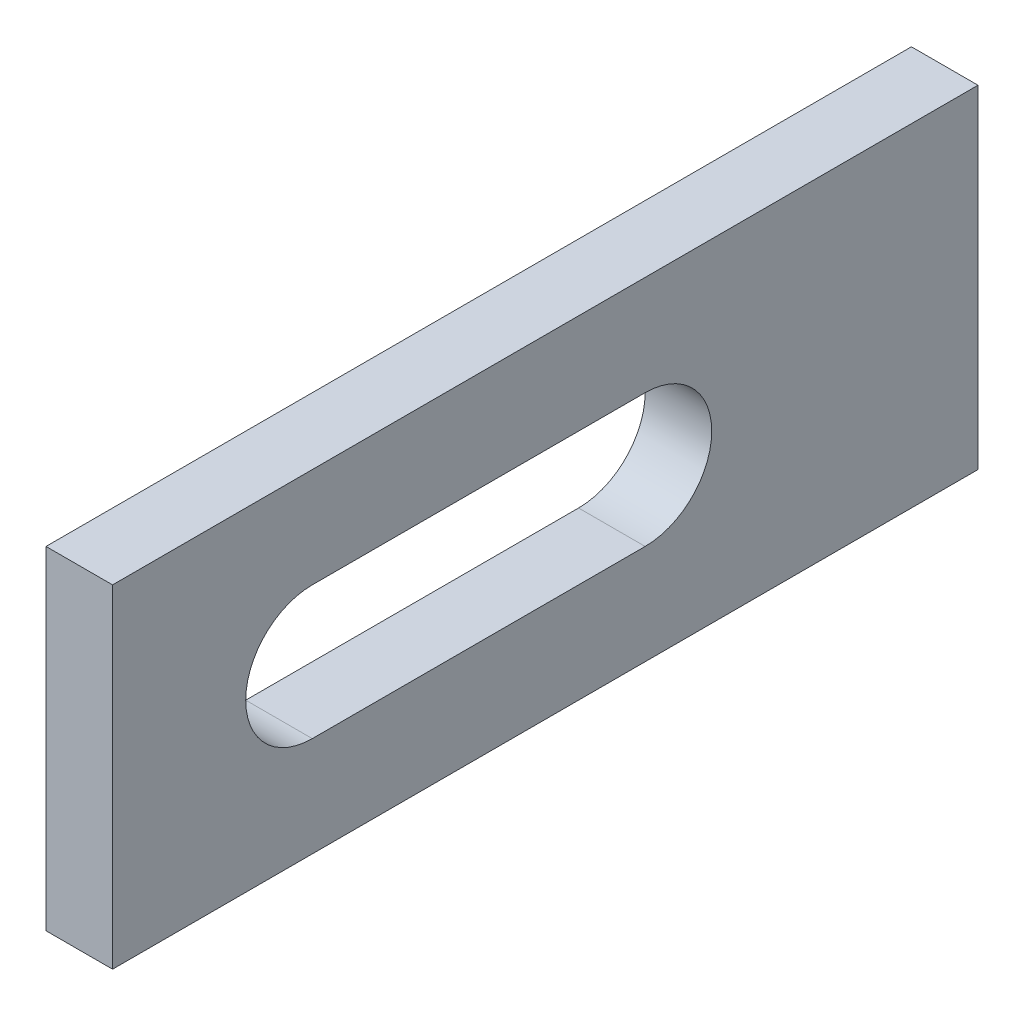
ISO-10303-21;
HEADER;
FILE_DESCRIPTION(('STEP AP214'),'2;1');
FILE_NAME('part.step','',(''),(''),'','','');
FILE_SCHEMA(('AUTOMOTIVE_DESIGN { 1 0 10303 214 1 1 1 1 }'));
ENDSEC;
DATA;
#1=APPLICATION_CONTEXT('core data for automotive mechanical design processes');
#2=APPLICATION_PROTOCOL_DEFINITION('international standard','automotive_design',2000,#1);
#3=PRODUCT_CONTEXT('',#1,'mechanical');
#4=PRODUCT('Part','Part','',(#3));
#5=PRODUCT_RELATED_PRODUCT_CATEGORY('part','',(#4));
#6=PRODUCT_DEFINITION_FORMATION('','',#4);
#7=PRODUCT_DEFINITION_CONTEXT('part definition',#1,'design');
#8=PRODUCT_DEFINITION('design','',#6,#7);
#9=PRODUCT_DEFINITION_SHAPE('','',#8);
#10=(LENGTH_UNIT() NAMED_UNIT(*) SI_UNIT(.MILLI.,.METRE.));
#11=(NAMED_UNIT(*) PLANE_ANGLE_UNIT() SI_UNIT($,.RADIAN.));
#12=(NAMED_UNIT(*) SI_UNIT($,.STERADIAN.) SOLID_ANGLE_UNIT());
#13=UNCERTAINTY_MEASURE_WITH_UNIT(LENGTH_MEASURE(1.E-05),#10,'distance_accuracy_value','');
#14=(GEOMETRIC_REPRESENTATION_CONTEXT(3) GLOBAL_UNCERTAINTY_ASSIGNED_CONTEXT((#13)) GLOBAL_UNIT_ASSIGNED_CONTEXT((#10,
#11,#12)) REPRESENTATION_CONTEXT('',''));
#15=CARTESIAN_POINT('',(0.,0.,0.));
#16=DIRECTION('',(0.,0.,1.));
#17=DIRECTION('',(1.,0.,0.));
#18=AXIS2_PLACEMENT_3D('',#15,#16,#17);
#19=CARTESIAN_POINT('',(-5.,-24.9999999999999,65.0000000000002));
#20=DIRECTION('',(1.,0.,0.));
#21=DIRECTION('',(0.,0.,-1.));
#22=AXIS2_PLACEMENT_3D('',#19,#20,#21);
#23=PLANE('',#22);
#24=DIRECTION('',(0.,0.,1.));
#25=VECTOR('',#24,1.);
#26=CARTESIAN_POINT('',(-5.,10.,65.0000000000002));
#27=LINE('',#26,#25);
#28=CARTESIAN_POINT('',(-5.00000000000001,10.,-14.9999999999999));
#29=VERTEX_POINT('',#28);
#30=CARTESIAN_POINT('',(-5.,10.0000000000005,34.9999999999999));
#31=VERTEX_POINT('',#30);
#32=EDGE_CURVE('E127',#29,#31,#27,.T.);
#33=ORIENTED_EDGE('',*,*,#32,.T.);
#34=CARTESIAN_POINT('',(-5.,2.22044604925031E-13,34.9999999999997));
#35=DIRECTION('',(1.,0.,0.));
#36=DIRECTION('',(0.,0.,-1.));
#37=AXIS2_PLACEMENT_3D('',#34,#35,#36);
#38=CIRCLE('',#37,10.);
#39=CARTESIAN_POINT('',(-5.,-9.99999999999979,35.0000000000001));
#40=VERTEX_POINT('',#39);
#41=EDGE_CURVE('E130',#31,#40,#38,.T.);
#42=ORIENTED_EDGE('',*,*,#41,.T.);
#43=DIRECTION('',(0.,0.,-1.));
#44=VECTOR('',#43,1.);
#45=CARTESIAN_POINT('',(-5.,-10.,65.0000000000002));
#46=LINE('',#45,#44);
#47=CARTESIAN_POINT('',(-5.,-10.,-15.));
#48=VERTEX_POINT('',#47);
#49=EDGE_CURVE('E122',#40,#48,#46,.T.);
#50=ORIENTED_EDGE('',*,*,#49,.T.);
#51=CARTESIAN_POINT('',(-5.,0.,-14.9999999999999));
#52=DIRECTION('',(1.,0.,0.));
#53=DIRECTION('',(0.,0.,-1.));
#54=AXIS2_PLACEMENT_3D('',#51,#52,#53);
#55=CIRCLE('',#54,10.);
#56=EDGE_CURVE('E102',#48,#29,#55,.T.);
#57=ORIENTED_EDGE('',*,*,#56,.T.);
#58=EDGE_LOOP('',(#33,#42,#50,#57));
#59=FACE_BOUND('',#58,.T.);
#60=DIRECTION('',(0.,-1.,0.));
#61=VECTOR('',#60,1.);
#62=CARTESIAN_POINT('',(-5.,-24.9999999999999,-64.9999999999999));
#63=LINE('',#62,#61);
#64=CARTESIAN_POINT('',(-5.,25.0000000000004,-64.9999999999999));
#65=VERTEX_POINT('',#64);
#66=CARTESIAN_POINT('',(-5.,-24.9999999999999,-64.9999999999999));
#67=VERTEX_POINT('',#66);
#68=EDGE_CURVE('E133',#65,#67,#63,.T.);
#69=ORIENTED_EDGE('',*,*,#68,.T.);
#70=DIRECTION('',(0.,0.,-1.));
#71=VECTOR('',#70,1.);
#72=CARTESIAN_POINT('',(-5.,-24.9999999999999,65.0000000000002));
#73=LINE('',#72,#71);
#74=CARTESIAN_POINT('',(-5.,-24.9999999999999,65.0000000000002));
#75=VERTEX_POINT('',#74);
#76=EDGE_CURVE('E11',#75,#67,#73,.T.);
#77=ORIENTED_EDGE('',*,*,#76,.F.);
#78=DIRECTION('',(0.,-1.,0.));
#79=VECTOR('',#78,1.);
#80=CARTESIAN_POINT('',(-5.,-24.9999999999999,65.0000000000002));
#81=LINE('',#80,#79);
#82=CARTESIAN_POINT('',(-5.,25.0000000000001,64.9999999999999));
#83=VERTEX_POINT('',#82);
#84=EDGE_CURVE('E134',#83,#75,#81,.T.);
#85=ORIENTED_EDGE('',*,*,#84,.F.);
#86=DIRECTION('',(0.,0.,-1.));
#87=VECTOR('',#86,1.);
#88=CARTESIAN_POINT('',(-5.,25.0000000000001,64.9999999999999));
#89=LINE('',#88,#87);
#90=EDGE_CURVE('E144',#83,#65,#89,.T.);
#91=ORIENTED_EDGE('',*,*,#90,.T.);
#92=EDGE_LOOP('',(#69,#77,#85,#91));
#93=FACE_BOUND('',#92,.T.);
#94=ADVANCED_FACE('F32',(#59,#93),#23,.F.);
#95=CARTESIAN_POINT('',(-5.,-24.9999999999999,65.0000000000002));
#96=DIRECTION('',(0.,1.,0.));
#97=DIRECTION('',(0.,0.,1.));
#98=AXIS2_PLACEMENT_3D('',#95,#96,#97);
#99=PLANE('',#98);
#100=DIRECTION('',(1.,0.,0.));
#101=VECTOR('',#100,1.);
#102=CARTESIAN_POINT('',(-5.,-24.9999999999999,-64.9999999999999));
#103=LINE('',#102,#101);
#104=CARTESIAN_POINT('',(5.,-24.9999999999999,-64.9999999999999));
#105=VERTEX_POINT('',#104);
#106=EDGE_CURVE('E147',#67,#105,#103,.T.);
#107=ORIENTED_EDGE('',*,*,#106,.T.);
#108=DIRECTION('',(0.,0.,-1.));
#109=VECTOR('',#108,1.);
#110=CARTESIAN_POINT('',(5.,-24.9999999999999,65.0000000000002));
#111=LINE('',#110,#109);
#112=CARTESIAN_POINT('',(5.,-24.9999999999999,65.0000000000002));
#113=VERTEX_POINT('',#112);
#114=EDGE_CURVE('E39',#113,#105,#111,.T.);
#115=ORIENTED_EDGE('',*,*,#114,.F.);
#116=DIRECTION('',(1.,0.,0.));
#117=VECTOR('',#116,1.);
#118=CARTESIAN_POINT('',(-5.,-24.9999999999999,65.0000000000002));
#119=LINE('',#118,#117);
#120=EDGE_CURVE('E137',#75,#113,#119,.T.);
#121=ORIENTED_EDGE('',*,*,#120,.F.);
#122=ORIENTED_EDGE('',*,*,#76,.T.);
#123=EDGE_LOOP('',(#107,#115,#121,#122));
#124=FACE_BOUND('',#123,.T.);
#125=ADVANCED_FACE('F175',(#124),#99,.F.);
#126=CARTESIAN_POINT('',(5.,-24.9999999999999,65.0000000000002));
#127=DIRECTION('',(-1.,0.,0.));
#128=DIRECTION('',(0.,0.,1.));
#129=AXIS2_PLACEMENT_3D('',#126,#127,#128);
#130=PLANE('',#129);
#131=DIRECTION('',(0.,0.,-1.));
#132=VECTOR('',#131,1.);
#133=CARTESIAN_POINT('',(5.,-9.99999999999979,-14.9999999999999));
#134=LINE('',#133,#132);
#135=CARTESIAN_POINT('',(5.,-9.99999999999979,35.0000000000001));
#136=VERTEX_POINT('',#135);
#137=CARTESIAN_POINT('',(5.,-10.,-15.));
#138=VERTEX_POINT('',#137);
#139=EDGE_CURVE('E108',#136,#138,#134,.T.);
#140=ORIENTED_EDGE('',*,*,#139,.F.);
#141=CARTESIAN_POINT('',(5.,2.22044604925031E-13,35.0000000000001));
#142=DIRECTION('',(1.,0.,0.));
#143=DIRECTION('',(0.,0.,-1.));
#144=AXIS2_PLACEMENT_3D('',#141,#142,#143);
#145=CIRCLE('',#144,10.);
#146=CARTESIAN_POINT('',(5.,10.0000000000002,34.9999999999997));
#147=VERTEX_POINT('',#146);
#148=EDGE_CURVE('E54',#147,#136,#145,.T.);
#149=ORIENTED_EDGE('',*,*,#148,.F.);
#150=DIRECTION('',(0.,0.,1.));
#151=VECTOR('',#150,1.);
#152=CARTESIAN_POINT('',(5.,10.0000000000002,34.9999999999997));
#153=LINE('',#152,#151);
#154=CARTESIAN_POINT('',(5.,9.99999999999979,-15.0000000000001));
#155=VERTEX_POINT('',#154);
#156=EDGE_CURVE('E115',#155,#147,#153,.T.);
#157=ORIENTED_EDGE('',*,*,#156,.F.);
#158=CARTESIAN_POINT('',(5.,0.,-14.9999999999999));
#159=DIRECTION('',(1.,0.,0.));
#160=DIRECTION('',(0.,0.,-1.));
#161=AXIS2_PLACEMENT_3D('',#158,#159,#160);
#162=CIRCLE('',#161,10.);
#163=EDGE_CURVE('E99',#138,#155,#162,.T.);
#164=ORIENTED_EDGE('',*,*,#163,.F.);
#165=EDGE_LOOP('',(#140,#149,#157,#164));
#166=FACE_BOUND('',#165,.T.);
#167=DIRECTION('',(0.,1.,0.));
#168=VECTOR('',#167,1.);
#169=CARTESIAN_POINT('',(5.,-24.9999999999999,-64.9999999999999));
#170=LINE('',#169,#168);
#171=CARTESIAN_POINT('',(5.,25.0000000000004,-64.9999999999999));
#172=VERTEX_POINT('',#171);
#173=EDGE_CURVE('E149',#105,#172,#170,.T.);
#174=ORIENTED_EDGE('',*,*,#173,.T.);
#175=DIRECTION('',(0.,0.,-1.));
#176=VECTOR('',#175,1.);
#177=CARTESIAN_POINT('',(5.,25.0000000000001,64.9999999999999));
#178=LINE('',#177,#176);
#179=CARTESIAN_POINT('',(5.,25.0000000000001,64.9999999999999));
#180=VERTEX_POINT('',#179);
#181=EDGE_CURVE('E154',#180,#172,#178,.T.);
#182=ORIENTED_EDGE('',*,*,#181,.F.);
#183=DIRECTION('',(0.,1.,0.));
#184=VECTOR('',#183,1.);
#185=CARTESIAN_POINT('',(5.,-24.9999999999999,65.0000000000002));
#186=LINE('',#185,#184);
#187=EDGE_CURVE('E140',#113,#180,#186,.T.);
#188=ORIENTED_EDGE('',*,*,#187,.F.);
#189=ORIENTED_EDGE('',*,*,#114,.T.);
#190=EDGE_LOOP('',(#174,#182,#188,#189));
#191=FACE_BOUND('',#190,.T.);
#192=ADVANCED_FACE('F112',(#166,#191),#130,.F.);
#193=CARTESIAN_POINT('',(-5.,25.0000000000001,64.9999999999999));
#194=DIRECTION('',(0.,-1.,0.));
#195=DIRECTION('',(0.,0.,-1.));
#196=AXIS2_PLACEMENT_3D('',#193,#194,#195);
#197=PLANE('',#196);
#198=DIRECTION('',(-1.,0.,0.));
#199=VECTOR('',#198,1.);
#200=CARTESIAN_POINT('',(-5.,25.0000000000004,-64.9999999999999));
#201=LINE('',#200,#199);
#202=EDGE_CURVE('E138',#172,#65,#201,.T.);
#203=ORIENTED_EDGE('',*,*,#202,.T.);
#204=ORIENTED_EDGE('',*,*,#90,.F.);
#205=DIRECTION('',(-1.,0.,0.));
#206=VECTOR('',#205,1.);
#207=CARTESIAN_POINT('',(-5.,25.0000000000001,64.9999999999999));
#208=LINE('',#207,#206);
#209=EDGE_CURVE('E142',#180,#83,#208,.T.);
#210=ORIENTED_EDGE('',*,*,#209,.F.);
#211=ORIENTED_EDGE('',*,*,#181,.T.);
#212=EDGE_LOOP('',(#203,#204,#210,#211));
#213=FACE_BOUND('',#212,.T.);
#214=ADVANCED_FACE('F168',(#213),#197,.F.);
#215=CARTESIAN_POINT('',(-5.,25.0000000000001,64.9999999999999));
#216=DIRECTION('',(0.,0.,-1.));
#217=DIRECTION('',(-1.,0.,0.));
#218=AXIS2_PLACEMENT_3D('',#215,#216,#217);
#219=PLANE('',#218);
#220=ORIENTED_EDGE('',*,*,#84,.T.);
#221=ORIENTED_EDGE('',*,*,#120,.T.);
#222=ORIENTED_EDGE('',*,*,#187,.T.);
#223=ORIENTED_EDGE('',*,*,#209,.T.);
#224=EDGE_LOOP('',(#220,#221,#222,#223));
#225=FACE_BOUND('',#224,.T.);
#226=ADVANCED_FACE('F174',(#225),#219,.F.);
#227=CARTESIAN_POINT('',(-5.,25.0000000000004,-64.9999999999999));
#228=DIRECTION('',(0.,0.,-1.));
#229=DIRECTION('',(-1.,0.,0.));
#230=AXIS2_PLACEMENT_3D('',#227,#228,#229);
#231=PLANE('',#230);
#232=ORIENTED_EDGE('',*,*,#68,.F.);
#233=ORIENTED_EDGE('',*,*,#202,.F.);
#234=ORIENTED_EDGE('',*,*,#173,.F.);
#235=ORIENTED_EDGE('',*,*,#106,.F.);
#236=EDGE_LOOP('',(#232,#233,#234,#235));
#237=FACE_BOUND('',#236,.T.);
#238=ADVANCED_FACE('F165',(#237),#231,.T.);
#239=CARTESIAN_POINT('',(-105.,0.,34.9999999999999));
#240=DIRECTION('',(1.,0.,0.));
#241=DIRECTION('',(0.,0.,-1.));
#242=AXIS2_PLACEMENT_3D('',#239,#240,#241);
#243=CYLINDRICAL_SURFACE('',#242,10.);
#244=DIRECTION('',(1.,0.,0.));
#245=VECTOR('',#244,1.);
#246=CARTESIAN_POINT('',(-105.,10.0000000000002,35.0000000000001));
#247=LINE('',#246,#245);
#248=EDGE_CURVE('E120',#31,#147,#247,.T.);
#249=ORIENTED_EDGE('',*,*,#248,.T.);
#250=ORIENTED_EDGE('',*,*,#148,.T.);
#251=DIRECTION('',(1.,0.,0.));
#252=VECTOR('',#251,1.);
#253=CARTESIAN_POINT('',(-105.,-10.,34.9999999999999));
#254=LINE('',#253,#252);
#255=EDGE_CURVE('E105',#40,#136,#254,.T.);
#256=ORIENTED_EDGE('',*,*,#255,.F.);
#257=ORIENTED_EDGE('',*,*,#41,.F.);
#258=EDGE_LOOP('',(#249,#250,#256,#257));
#259=FACE_BOUND('',#258,.T.);
#260=ADVANCED_FACE('F188',(#259),#243,.F.);
#261=CARTESIAN_POINT('',(-105.,10.0000000000002,35.0000000000001));
#262=DIRECTION('',(0.,1.,0.));
#263=DIRECTION('',(0.,0.,1.));
#264=AXIS2_PLACEMENT_3D('',#261,#262,#263);
#265=PLANE('',#264);
#266=DIRECTION('',(1.,0.,0.));
#267=VECTOR('',#266,1.);
#268=CARTESIAN_POINT('',(-105.,10.0000000000002,-15.));
#269=LINE('',#268,#267);
#270=EDGE_CURVE('E104',#29,#155,#269,.T.);
#271=ORIENTED_EDGE('',*,*,#270,.T.);
#272=ORIENTED_EDGE('',*,*,#156,.T.);
#273=ORIENTED_EDGE('',*,*,#248,.F.);
#274=ORIENTED_EDGE('',*,*,#32,.F.);
#275=EDGE_LOOP('',(#271,#272,#273,#274));
#276=FACE_BOUND('',#275,.T.);
#277=ADVANCED_FACE('F193',(#276),#265,.F.);
#278=CARTESIAN_POINT('',(-105.,0.,-15.));
#279=DIRECTION('',(1.,0.,0.));
#280=DIRECTION('',(0.,0.,-1.));
#281=AXIS2_PLACEMENT_3D('',#278,#279,#280);
#282=CYLINDRICAL_SURFACE('',#281,10.);
#283=DIRECTION('',(1.,0.,0.));
#284=VECTOR('',#283,1.);
#285=CARTESIAN_POINT('',(-105.,-9.99999999999979,-14.9999999999999));
#286=LINE('',#285,#284);
#287=EDGE_CURVE('E46',#48,#138,#286,.T.);
#288=ORIENTED_EDGE('',*,*,#287,.T.);
#289=ORIENTED_EDGE('',*,*,#163,.T.);
#290=ORIENTED_EDGE('',*,*,#270,.F.);
#291=ORIENTED_EDGE('',*,*,#56,.F.);
#292=EDGE_LOOP('',(#288,#289,#290,#291));
#293=FACE_BOUND('',#292,.T.);
#294=ADVANCED_FACE('F96',(#293),#282,.F.);
#295=CARTESIAN_POINT('',(-105.,-10.0000000000002,-15.0000000000001));
#296=DIRECTION('',(0.,-1.,0.));
#297=DIRECTION('',(0.,0.,-1.));
#298=AXIS2_PLACEMENT_3D('',#295,#296,#297);
#299=PLANE('',#298);
#300=ORIENTED_EDGE('',*,*,#255,.T.);
#301=ORIENTED_EDGE('',*,*,#139,.T.);
#302=ORIENTED_EDGE('',*,*,#287,.F.);
#303=ORIENTED_EDGE('',*,*,#49,.F.);
#304=EDGE_LOOP('',(#300,#301,#302,#303));
#305=FACE_BOUND('',#304,.T.);
#306=ADVANCED_FACE('F109',(#305),#299,.F.);
#307=CLOSED_SHELL('',(#94,#125,#192,#214,#226,#238,#260,#277,#294,#306));
#308=MANIFOLD_SOLID_BREP('B2',#307);
#309=ADVANCED_BREP_SHAPE_REPRESENTATION('',(#18,#308),#14);
#310=SHAPE_DEFINITION_REPRESENTATION(#9,#309);
ENDSEC;
END-ISO-10303-21;
